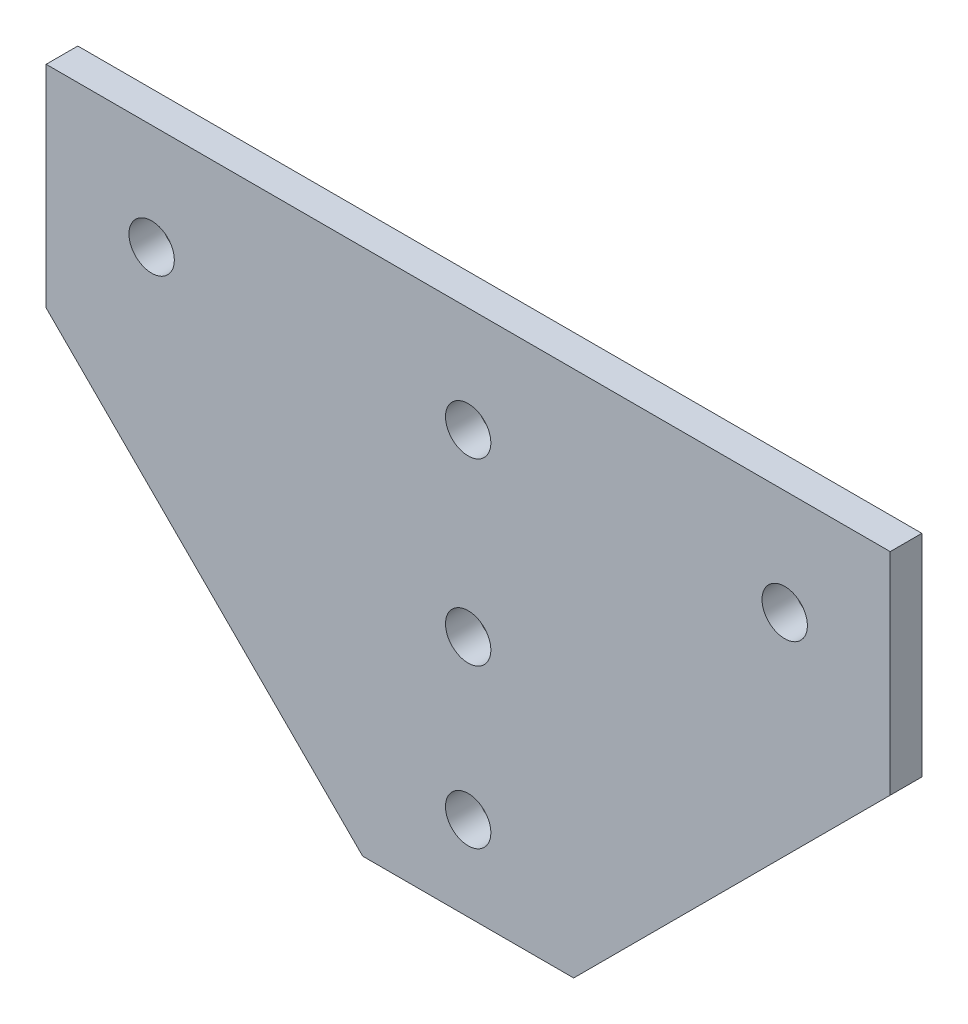
ISO-10303-21;
HEADER;
FILE_DESCRIPTION(('STEP AP214'),'2;1');
FILE_NAME('part.step','',(''),(''),'','','');
FILE_SCHEMA(('AUTOMOTIVE_DESIGN { 1 0 10303 214 1 1 1 1 }'));
ENDSEC;
DATA;
#1=APPLICATION_CONTEXT('core data for automotive mechanical design processes');
#2=APPLICATION_PROTOCOL_DEFINITION('international standard','automotive_design',2000,#1);
#3=PRODUCT_CONTEXT('',#1,'mechanical');
#4=PRODUCT('Part','Part','',(#3));
#5=PRODUCT_RELATED_PRODUCT_CATEGORY('part','',(#4));
#6=PRODUCT_DEFINITION_FORMATION('','',#4);
#7=PRODUCT_DEFINITION_CONTEXT('part definition',#1,'design');
#8=PRODUCT_DEFINITION('design','',#6,#7);
#9=PRODUCT_DEFINITION_SHAPE('','',#8);
#10=(LENGTH_UNIT() NAMED_UNIT(*) SI_UNIT(.MILLI.,.METRE.));
#11=(NAMED_UNIT(*) PLANE_ANGLE_UNIT() SI_UNIT($,.RADIAN.));
#12=(NAMED_UNIT(*) SI_UNIT($,.STERADIAN.) SOLID_ANGLE_UNIT());
#13=UNCERTAINTY_MEASURE_WITH_UNIT(LENGTH_MEASURE(1.E-05),#10,'distance_accuracy_value','');
#14=(GEOMETRIC_REPRESENTATION_CONTEXT(3) GLOBAL_UNCERTAINTY_ASSIGNED_CONTEXT((#13)) GLOBAL_UNIT_ASSIGNED_CONTEXT((#10,
#11,#12)) REPRESENTATION_CONTEXT('',''));
#15=CARTESIAN_POINT('',(0.,0.,0.));
#16=DIRECTION('',(0.,0.,1.));
#17=DIRECTION('',(1.,0.,0.));
#18=AXIS2_PLACEMENT_3D('',#15,#16,#17);
#19=CARTESIAN_POINT('',(0.,0.,3.));
#20=DIRECTION('',(0.,0.,1.));
#21=DIRECTION('',(1.,0.,0.));
#22=AXIS2_PLACEMENT_3D('',#19,#20,#21);
#23=PLANE('',#22);
#24=CARTESIAN_POINT('',(-372.094950634694,-7.,3.));
#25=DIRECTION('',(0.,0.,1.));
#26=DIRECTION('',(1.,0.,0.));
#27=AXIS2_PLACEMENT_3D('',#24,#25,#26);
#28=CIRCLE('',#27,2.14999999999996);
#29=CARTESIAN_POINT('',(-369.944950634694,-7.,3.));
#30=VERTEX_POINT('',#29);
#31=EDGE_CURVE('E195',#30,#30,#28,.T.);
#32=ORIENTED_EDGE('',*,*,#31,.F.);
#33=EDGE_LOOP('',(#32));
#34=FACE_BOUND('',#33,.T.);
#35=CARTESIAN_POINT('',(-342.094950634694,10.,3.));
#36=DIRECTION('',(0.,0.,1.));
#37=DIRECTION('',(1.,0.,0.));
#38=AXIS2_PLACEMENT_3D('',#35,#36,#37);
#39=CIRCLE('',#38,2.14999999999996);
#40=CARTESIAN_POINT('',(-339.944950634694,10.,3.));
#41=VERTEX_POINT('',#40);
#42=EDGE_CURVE('E207',#41,#41,#39,.T.);
#43=ORIENTED_EDGE('',*,*,#42,.F.);
#44=EDGE_LOOP('',(#43));
#45=FACE_BOUND('',#44,.T.);
#46=DIRECTION('',(-1.,0.,0.));
#47=VECTOR('',#46,1.);
#48=CARTESIAN_POINT('',(-332.094950634694,20.,3.));
#49=LINE('',#48,#47);
#50=CARTESIAN_POINT('',(-332.094950634694,20.,3.));
#51=VERTEX_POINT('',#50);
#52=CARTESIAN_POINT('',(-412.094950634694,20.,3.));
#53=VERTEX_POINT('',#52);
#54=EDGE_CURVE('E131',#51,#53,#49,.T.);
#55=ORIENTED_EDGE('',*,*,#54,.T.);
#56=DIRECTION('',(0.,-1.,0.));
#57=VECTOR('',#56,1.);
#58=CARTESIAN_POINT('',(-412.094950634694,20.,3.));
#59=LINE('',#58,#57);
#60=CARTESIAN_POINT('',(-412.094950634694,0.,3.));
#61=VERTEX_POINT('',#60);
#62=EDGE_CURVE('E89',#53,#61,#59,.T.);
#63=ORIENTED_EDGE('',*,*,#62,.T.);
#64=DIRECTION('',(0.707106781186548,-0.707106781186547,0.));
#65=VECTOR('',#64,1.);
#66=CARTESIAN_POINT('',(-412.094950634694,0.,3.));
#67=LINE('',#66,#65);
#68=CARTESIAN_POINT('',(-382.094950634694,-30.,3.));
#69=VERTEX_POINT('',#68);
#70=EDGE_CURVE('E102',#61,#69,#67,.T.);
#71=ORIENTED_EDGE('',*,*,#70,.T.);
#72=DIRECTION('',(1.,0.,0.));
#73=VECTOR('',#72,1.);
#74=CARTESIAN_POINT('',(-382.094950634694,-30.,3.));
#75=LINE('',#74,#73);
#76=CARTESIAN_POINT('',(-362.094950634694,-30.,3.));
#77=VERTEX_POINT('',#76);
#78=EDGE_CURVE('E96',#69,#77,#75,.T.);
#79=ORIENTED_EDGE('',*,*,#78,.T.);
#80=DIRECTION('',(0.707106781186548,0.707106781186547,0.));
#81=VECTOR('',#80,1.);
#82=CARTESIAN_POINT('',(-362.094950634694,-30.,3.));
#83=LINE('',#82,#81);
#84=CARTESIAN_POINT('',(-332.094950634694,0.,3.));
#85=VERTEX_POINT('',#84);
#86=EDGE_CURVE('E100',#77,#85,#83,.T.);
#87=ORIENTED_EDGE('',*,*,#86,.T.);
#88=DIRECTION('',(0.,1.,0.));
#89=VECTOR('',#88,1.);
#90=CARTESIAN_POINT('',(-332.094950634694,0.,3.));
#91=LINE('',#90,#89);
#92=EDGE_CURVE('E52',#85,#51,#91,.T.);
#93=ORIENTED_EDGE('',*,*,#92,.T.);
#94=EDGE_LOOP('',(#55,#63,#71,#79,#87,#93));
#95=FACE_BOUND('',#94,.T.);
#96=CARTESIAN_POINT('',(-402.094950634694,10.,3.));
#97=DIRECTION('',(0.,0.,1.));
#98=DIRECTION('',(1.,0.,0.));
#99=AXIS2_PLACEMENT_3D('',#96,#97,#98);
#100=CIRCLE('',#99,2.14999999999996);
#101=CARTESIAN_POINT('',(-399.944950634694,10.,3.));
#102=VERTEX_POINT('',#101);
#103=EDGE_CURVE('E124',#102,#102,#100,.T.);
#104=ORIENTED_EDGE('',*,*,#103,.F.);
#105=EDGE_LOOP('',(#104));
#106=FACE_BOUND('',#105,.T.);
#107=CARTESIAN_POINT('',(-372.094950634694,-22.,3.));
#108=DIRECTION('',(0.,0.,1.));
#109=DIRECTION('',(1.,0.,0.));
#110=AXIS2_PLACEMENT_3D('',#107,#108,#109);
#111=CIRCLE('',#110,2.14999999999996);
#112=CARTESIAN_POINT('',(-369.944950634694,-22.,3.));
#113=VERTEX_POINT('',#112);
#114=EDGE_CURVE('E201',#113,#113,#111,.T.);
#115=ORIENTED_EDGE('',*,*,#114,.F.);
#116=EDGE_LOOP('',(#115));
#117=FACE_BOUND('',#116,.T.);
#118=CARTESIAN_POINT('',(-372.094950634694,10.,3.));
#119=DIRECTION('',(0.,0.,1.));
#120=DIRECTION('',(1.,0.,0.));
#121=AXIS2_PLACEMENT_3D('',#118,#119,#120);
#122=CIRCLE('',#121,2.14999999999996);
#123=CARTESIAN_POINT('',(-369.944950634694,10.,3.));
#124=VERTEX_POINT('',#123);
#125=EDGE_CURVE('E186',#124,#124,#122,.T.);
#126=ORIENTED_EDGE('',*,*,#125,.F.);
#127=EDGE_LOOP('',(#126));
#128=FACE_BOUND('',#127,.T.);
#129=ADVANCED_FACE('F35',(#34,#45,#95,#106,#117,#128),#23,.T.);
#130=CARTESIAN_POINT('',(0.,0.,0.));
#131=DIRECTION('',(0.,0.,1.));
#132=DIRECTION('',(1.,0.,0.));
#133=AXIS2_PLACEMENT_3D('',#130,#131,#132);
#134=PLANE('',#133);
#135=DIRECTION('',(-1.,0.,0.));
#136=VECTOR('',#135,1.);
#137=CARTESIAN_POINT('',(-332.094950634694,20.,0.));
#138=LINE('',#137,#136);
#139=CARTESIAN_POINT('',(-332.094950634694,20.,0.));
#140=VERTEX_POINT('',#139);
#141=CARTESIAN_POINT('',(-412.094950634694,20.,0.));
#142=VERTEX_POINT('',#141);
#143=EDGE_CURVE('E120',#140,#142,#138,.T.);
#144=ORIENTED_EDGE('',*,*,#143,.F.);
#145=DIRECTION('',(0.,1.,0.));
#146=VECTOR('',#145,1.);
#147=CARTESIAN_POINT('',(-332.094950634694,0.,0.));
#148=LINE('',#147,#146);
#149=CARTESIAN_POINT('',(-332.094950634694,0.,0.));
#150=VERTEX_POINT('',#149);
#151=EDGE_CURVE('E81',#150,#140,#148,.T.);
#152=ORIENTED_EDGE('',*,*,#151,.F.);
#153=DIRECTION('',(0.707106781186548,0.707106781186547,0.));
#154=VECTOR('',#153,1.);
#155=CARTESIAN_POINT('',(-362.094950634694,-30.,0.));
#156=LINE('',#155,#154);
#157=CARTESIAN_POINT('',(-362.094950634694,-30.,0.));
#158=VERTEX_POINT('',#157);
#159=EDGE_CURVE('E75',#158,#150,#156,.T.);
#160=ORIENTED_EDGE('',*,*,#159,.F.);
#161=DIRECTION('',(1.,0.,0.));
#162=VECTOR('',#161,1.);
#163=CARTESIAN_POINT('',(-382.094950634694,-30.,0.));
#164=LINE('',#163,#162);
#165=CARTESIAN_POINT('',(-382.094950634694,-30.,0.));
#166=VERTEX_POINT('',#165);
#167=EDGE_CURVE('E110',#166,#158,#164,.T.);
#168=ORIENTED_EDGE('',*,*,#167,.F.);
#169=DIRECTION('',(0.707106781186548,-0.707106781186547,0.));
#170=VECTOR('',#169,1.);
#171=CARTESIAN_POINT('',(-412.094950634694,0.,0.));
#172=LINE('',#171,#170);
#173=CARTESIAN_POINT('',(-412.094950634694,0.,0.));
#174=VERTEX_POINT('',#173);
#175=EDGE_CURVE('E126',#174,#166,#172,.T.);
#176=ORIENTED_EDGE('',*,*,#175,.F.);
#177=DIRECTION('',(0.,-1.,0.));
#178=VECTOR('',#177,1.);
#179=CARTESIAN_POINT('',(-412.094950634694,20.,0.));
#180=LINE('',#179,#178);
#181=EDGE_CURVE('E123',#142,#174,#180,.T.);
#182=ORIENTED_EDGE('',*,*,#181,.F.);
#183=EDGE_LOOP('',(#144,#152,#160,#168,#176,#182));
#184=FACE_BOUND('',#183,.T.);
#185=CARTESIAN_POINT('',(-402.094950634694,10.,0.));
#186=DIRECTION('',(0.,0.,1.));
#187=DIRECTION('',(1.,0.,0.));
#188=AXIS2_PLACEMENT_3D('',#185,#186,#187);
#189=CIRCLE('',#188,2.14999999999996);
#190=CARTESIAN_POINT('',(-399.944950634694,10.,0.));
#191=VERTEX_POINT('',#190);
#192=EDGE_CURVE('E210',#191,#191,#189,.T.);
#193=ORIENTED_EDGE('',*,*,#192,.T.);
#194=EDGE_LOOP('',(#193));
#195=FACE_BOUND('',#194,.T.);
#196=CARTESIAN_POINT('',(-342.094950634694,10.,0.));
#197=DIRECTION('',(0.,0.,1.));
#198=DIRECTION('',(1.,0.,0.));
#199=AXIS2_PLACEMENT_3D('',#196,#197,#198);
#200=CIRCLE('',#199,2.14999999999996);
#201=CARTESIAN_POINT('',(-339.944950634694,10.,0.));
#202=VERTEX_POINT('',#201);
#203=EDGE_CURVE('E204',#202,#202,#200,.T.);
#204=ORIENTED_EDGE('',*,*,#203,.T.);
#205=EDGE_LOOP('',(#204));
#206=FACE_BOUND('',#205,.T.);
#207=CARTESIAN_POINT('',(-372.094950634694,-22.,0.));
#208=DIRECTION('',(0.,0.,1.));
#209=DIRECTION('',(1.,0.,0.));
#210=AXIS2_PLACEMENT_3D('',#207,#208,#209);
#211=CIRCLE('',#210,2.14999999999996);
#212=CARTESIAN_POINT('',(-369.944950634694,-22.,0.));
#213=VERTEX_POINT('',#212);
#214=EDGE_CURVE('E198',#213,#213,#211,.T.);
#215=ORIENTED_EDGE('',*,*,#214,.T.);
#216=EDGE_LOOP('',(#215));
#217=FACE_BOUND('',#216,.T.);
#218=CARTESIAN_POINT('',(-372.094950634694,-7.,0.));
#219=DIRECTION('',(0.,0.,1.));
#220=DIRECTION('',(1.,0.,0.));
#221=AXIS2_PLACEMENT_3D('',#218,#219,#220);
#222=CIRCLE('',#221,2.14999999999996);
#223=CARTESIAN_POINT('',(-369.944950634694,-7.,0.));
#224=VERTEX_POINT('',#223);
#225=EDGE_CURVE('E192',#224,#224,#222,.T.);
#226=ORIENTED_EDGE('',*,*,#225,.T.);
#227=EDGE_LOOP('',(#226));
#228=FACE_BOUND('',#227,.T.);
#229=CARTESIAN_POINT('',(-372.094950634694,10.,0.));
#230=DIRECTION('',(0.,0.,1.));
#231=DIRECTION('',(1.,0.,0.));
#232=AXIS2_PLACEMENT_3D('',#229,#230,#231);
#233=CIRCLE('',#232,2.14999999999996);
#234=CARTESIAN_POINT('',(-369.944950634694,10.,0.));
#235=VERTEX_POINT('',#234);
#236=EDGE_CURVE('E189',#235,#235,#233,.T.);
#237=ORIENTED_EDGE('',*,*,#236,.T.);
#238=EDGE_LOOP('',(#237));
#239=FACE_BOUND('',#238,.T.);
#240=ADVANCED_FACE('F140',(#184,#195,#206,#217,#228,#239),#134,.F.);
#241=CARTESIAN_POINT('',(-332.094950634694,20.,3.));
#242=DIRECTION('',(0.,-1.,0.));
#243=DIRECTION('',(1.,0.,0.));
#244=AXIS2_PLACEMENT_3D('',#241,#242,#243);
#245=PLANE('',#244);
#246=ORIENTED_EDGE('',*,*,#143,.T.);
#247=DIRECTION('',(0.,0.,-1.));
#248=VECTOR('',#247,1.);
#249=CARTESIAN_POINT('',(-412.094950634694,20.,3.));
#250=LINE('',#249,#248);
#251=EDGE_CURVE('E11',#53,#142,#250,.T.);
#252=ORIENTED_EDGE('',*,*,#251,.F.);
#253=ORIENTED_EDGE('',*,*,#54,.F.);
#254=DIRECTION('',(0.,0.,-1.));
#255=VECTOR('',#254,1.);
#256=CARTESIAN_POINT('',(-332.094950634694,20.,3.));
#257=LINE('',#256,#255);
#258=EDGE_CURVE('E116',#51,#140,#257,.T.);
#259=ORIENTED_EDGE('',*,*,#258,.T.);
#260=EDGE_LOOP('',(#246,#252,#253,#259));
#261=FACE_BOUND('',#260,.T.);
#262=ADVANCED_FACE('F37',(#261),#245,.F.);
#263=CARTESIAN_POINT('',(-412.094950634694,20.,3.));
#264=DIRECTION('',(1.,0.,0.));
#265=DIRECTION('',(0.,0.,-1.));
#266=AXIS2_PLACEMENT_3D('',#263,#264,#265);
#267=PLANE('',#266);
#268=ORIENTED_EDGE('',*,*,#181,.T.);
#269=DIRECTION('',(0.,0.,-1.));
#270=VECTOR('',#269,1.);
#271=CARTESIAN_POINT('',(-412.094950634694,0.,3.));
#272=LINE('',#271,#270);
#273=EDGE_CURVE('E44',#61,#174,#272,.T.);
#274=ORIENTED_EDGE('',*,*,#273,.F.);
#275=ORIENTED_EDGE('',*,*,#62,.F.);
#276=ORIENTED_EDGE('',*,*,#251,.T.);
#277=EDGE_LOOP('',(#268,#274,#275,#276));
#278=FACE_BOUND('',#277,.T.);
#279=ADVANCED_FACE('F277',(#278),#267,.F.);
#280=CARTESIAN_POINT('',(-412.094950634694,0.,3.));
#281=DIRECTION('',(0.707106781186547,0.707106781186548,0.));
#282=DIRECTION('',(-0.707106781186548,0.707106781186547,0.));
#283=AXIS2_PLACEMENT_3D('',#280,#281,#282);
#284=PLANE('',#283);
#285=ORIENTED_EDGE('',*,*,#175,.T.);
#286=DIRECTION('',(0.,0.,-1.));
#287=VECTOR('',#286,1.);
#288=CARTESIAN_POINT('',(-382.094950634694,-30.,3.));
#289=LINE('',#288,#287);
#290=EDGE_CURVE('E111',#69,#166,#289,.T.);
#291=ORIENTED_EDGE('',*,*,#290,.F.);
#292=ORIENTED_EDGE('',*,*,#70,.F.);
#293=ORIENTED_EDGE('',*,*,#273,.T.);
#294=EDGE_LOOP('',(#285,#291,#292,#293));
#295=FACE_BOUND('',#294,.T.);
#296=ADVANCED_FACE('F137',(#295),#284,.F.);
#297=CARTESIAN_POINT('',(-382.094950634694,-30.,3.));
#298=DIRECTION('',(0.,1.,0.));
#299=DIRECTION('',(0.,0.,1.));
#300=AXIS2_PLACEMENT_3D('',#297,#298,#299);
#301=PLANE('',#300);
#302=ORIENTED_EDGE('',*,*,#167,.T.);
#303=DIRECTION('',(0.,0.,-1.));
#304=VECTOR('',#303,1.);
#305=CARTESIAN_POINT('',(-362.094950634694,-30.,3.));
#306=LINE('',#305,#304);
#307=EDGE_CURVE('E107',#77,#158,#306,.T.);
#308=ORIENTED_EDGE('',*,*,#307,.F.);
#309=ORIENTED_EDGE('',*,*,#78,.F.);
#310=ORIENTED_EDGE('',*,*,#290,.T.);
#311=EDGE_LOOP('',(#302,#308,#309,#310));
#312=FACE_BOUND('',#311,.T.);
#313=ADVANCED_FACE('F108',(#312),#301,.F.);
#314=CARTESIAN_POINT('',(-362.094950634694,-30.,3.));
#315=DIRECTION('',(-0.707106781186547,0.707106781186548,0.));
#316=DIRECTION('',(-0.707106781186548,-0.707106781186547,0.));
#317=AXIS2_PLACEMENT_3D('',#314,#315,#316);
#318=PLANE('',#317);
#319=ORIENTED_EDGE('',*,*,#159,.T.);
#320=DIRECTION('',(0.,0.,-1.));
#321=VECTOR('',#320,1.);
#322=CARTESIAN_POINT('',(-332.094950634694,0.,3.));
#323=LINE('',#322,#321);
#324=EDGE_CURVE('E112',#85,#150,#323,.T.);
#325=ORIENTED_EDGE('',*,*,#324,.F.);
#326=ORIENTED_EDGE('',*,*,#86,.F.);
#327=ORIENTED_EDGE('',*,*,#307,.T.);
#328=EDGE_LOOP('',(#319,#325,#326,#327));
#329=FACE_BOUND('',#328,.T.);
#330=ADVANCED_FACE('F114',(#329),#318,.F.);
#331=CARTESIAN_POINT('',(-332.094950634694,0.,3.));
#332=DIRECTION('',(-1.,0.,0.));
#333=DIRECTION('',(0.,0.,1.));
#334=AXIS2_PLACEMENT_3D('',#331,#332,#333);
#335=PLANE('',#334);
#336=ORIENTED_EDGE('',*,*,#151,.T.);
#337=ORIENTED_EDGE('',*,*,#258,.F.);
#338=ORIENTED_EDGE('',*,*,#92,.F.);
#339=ORIENTED_EDGE('',*,*,#324,.T.);
#340=EDGE_LOOP('',(#336,#337,#338,#339));
#341=FACE_BOUND('',#340,.T.);
#342=ADVANCED_FACE('F145',(#341),#335,.F.);
#343=CARTESIAN_POINT('',(-402.094950634694,10.,3.));
#344=DIRECTION('',(0.,0.,-1.));
#345=DIRECTION('',(-1.,0.,0.));
#346=AXIS2_PLACEMENT_3D('',#343,#344,#345);
#347=CYLINDRICAL_SURFACE('',#346,2.14999999999996);
#348=ORIENTED_EDGE('',*,*,#103,.T.);
#349=EDGE_LOOP('',(#348));
#350=FACE_BOUND('',#349,.T.);
#351=ORIENTED_EDGE('',*,*,#192,.F.);
#352=EDGE_LOOP('',(#351));
#353=FACE_BOUND('',#352,.T.);
#354=ADVANCED_FACE('F147',(#350,#353),#347,.F.);
#355=CARTESIAN_POINT('',(-342.094950634694,10.,3.));
#356=DIRECTION('',(0.,0.,-1.));
#357=DIRECTION('',(-1.,0.,0.));
#358=AXIS2_PLACEMENT_3D('',#355,#356,#357);
#359=CYLINDRICAL_SURFACE('',#358,2.14999999999996);
#360=ORIENTED_EDGE('',*,*,#42,.T.);
#361=EDGE_LOOP('',(#360));
#362=FACE_BOUND('',#361,.T.);
#363=ORIENTED_EDGE('',*,*,#203,.F.);
#364=EDGE_LOOP('',(#363));
#365=FACE_BOUND('',#364,.T.);
#366=ADVANCED_FACE('F153',(#362,#365),#359,.F.);
#367=CARTESIAN_POINT('',(-372.094950634694,-22.,3.));
#368=DIRECTION('',(0.,0.,-1.));
#369=DIRECTION('',(-1.,0.,0.));
#370=AXIS2_PLACEMENT_3D('',#367,#368,#369);
#371=CYLINDRICAL_SURFACE('',#370,2.14999999999996);
#372=ORIENTED_EDGE('',*,*,#114,.T.);
#373=EDGE_LOOP('',(#372));
#374=FACE_BOUND('',#373,.T.);
#375=ORIENTED_EDGE('',*,*,#214,.F.);
#376=EDGE_LOOP('',(#375));
#377=FACE_BOUND('',#376,.T.);
#378=ADVANCED_FACE('F169',(#374,#377),#371,.F.);
#379=CARTESIAN_POINT('',(-372.094950634694,-7.,3.));
#380=DIRECTION('',(0.,0.,-1.));
#381=DIRECTION('',(-1.,0.,0.));
#382=AXIS2_PLACEMENT_3D('',#379,#380,#381);
#383=CYLINDRICAL_SURFACE('',#382,2.14999999999996);
#384=ORIENTED_EDGE('',*,*,#31,.T.);
#385=EDGE_LOOP('',(#384));
#386=FACE_BOUND('',#385,.T.);
#387=ORIENTED_EDGE('',*,*,#225,.F.);
#388=EDGE_LOOP('',(#387));
#389=FACE_BOUND('',#388,.T.);
#390=ADVANCED_FACE('F173',(#386,#389),#383,.F.);
#391=CARTESIAN_POINT('',(-372.094950634694,10.,3.));
#392=DIRECTION('',(0.,0.,-1.));
#393=DIRECTION('',(-1.,0.,0.));
#394=AXIS2_PLACEMENT_3D('',#391,#392,#393);
#395=CYLINDRICAL_SURFACE('',#394,2.14999999999996);
#396=ORIENTED_EDGE('',*,*,#125,.T.);
#397=EDGE_LOOP('',(#396));
#398=FACE_BOUND('',#397,.T.);
#399=ORIENTED_EDGE('',*,*,#236,.F.);
#400=EDGE_LOOP('',(#399));
#401=FACE_BOUND('',#400,.T.);
#402=ADVANCED_FACE('F177',(#398,#401),#395,.F.);
#403=CLOSED_SHELL('',(#129,#240,#262,#279,#296,#313,#330,#342,#354,#366,#378,#390,#402));
#404=MANIFOLD_SOLID_BREP('B2',#403);
#405=ADVANCED_BREP_SHAPE_REPRESENTATION('',(#18,#404),#14);
#406=SHAPE_DEFINITION_REPRESENTATION(#9,#405);
ENDSEC;
END-ISO-10303-21;
